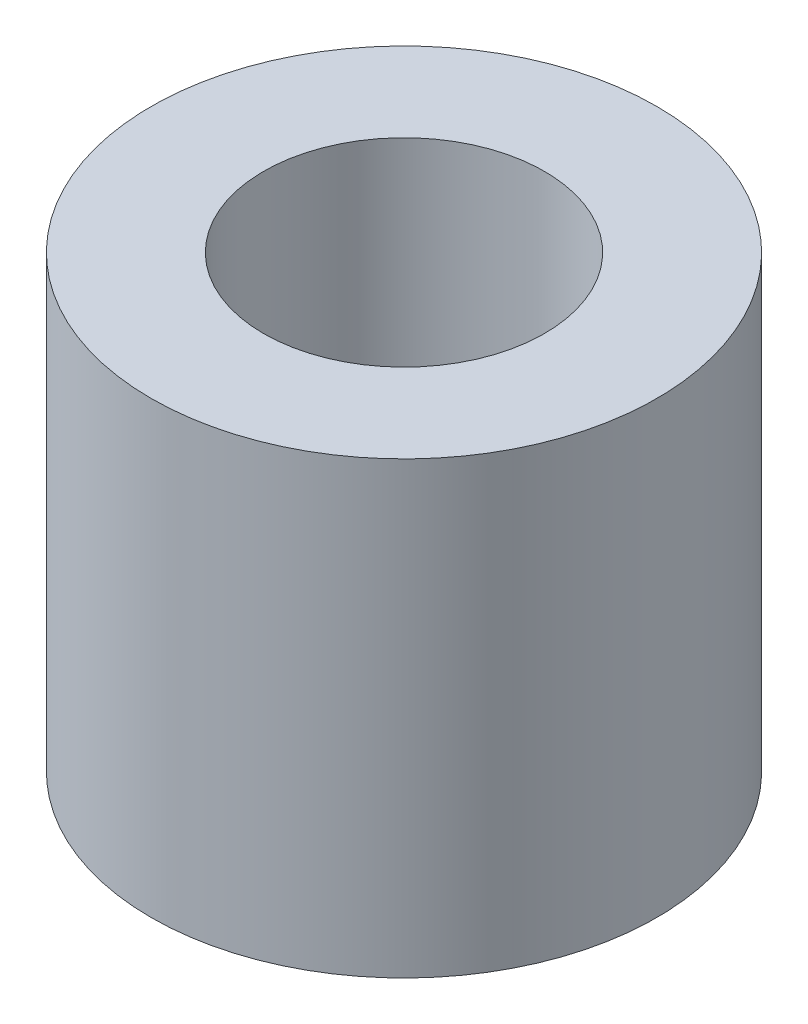
ISO-10303-21;
HEADER;
FILE_DESCRIPTION(('STEP AP214'),'2;1');
FILE_NAME('part.step','',(''),(''),'','','');
FILE_SCHEMA(('AUTOMOTIVE_DESIGN { 1 0 10303 214 1 1 1 1 }'));
ENDSEC;
DATA;
#1=APPLICATION_CONTEXT('core data for automotive mechanical design processes');
#2=APPLICATION_PROTOCOL_DEFINITION('international standard','automotive_design',2000,#1);
#3=PRODUCT_CONTEXT('',#1,'mechanical');
#4=PRODUCT('Part','Part','',(#3));
#5=PRODUCT_RELATED_PRODUCT_CATEGORY('part','',(#4));
#6=PRODUCT_DEFINITION_FORMATION('','',#4);
#7=PRODUCT_DEFINITION_CONTEXT('part definition',#1,'design');
#8=PRODUCT_DEFINITION('design','',#6,#7);
#9=PRODUCT_DEFINITION_SHAPE('','',#8);
#10=(LENGTH_UNIT() NAMED_UNIT(*) SI_UNIT(.MILLI.,.METRE.));
#11=(NAMED_UNIT(*) PLANE_ANGLE_UNIT() SI_UNIT($,.RADIAN.));
#12=(NAMED_UNIT(*) SI_UNIT($,.STERADIAN.) SOLID_ANGLE_UNIT());
#13=UNCERTAINTY_MEASURE_WITH_UNIT(LENGTH_MEASURE(1.E-05),#10,'distance_accuracy_value','');
#14=(GEOMETRIC_REPRESENTATION_CONTEXT(3) GLOBAL_UNCERTAINTY_ASSIGNED_CONTEXT((#13)) GLOBAL_UNIT_ASSIGNED_CONTEXT((#10,
#11,#12)) REPRESENTATION_CONTEXT('',''));
#15=CARTESIAN_POINT('',(0.,0.,0.));
#16=DIRECTION('',(0.,0.,1.));
#17=DIRECTION('',(1.,0.,0.));
#18=AXIS2_PLACEMENT_3D('',#15,#16,#17);
#19=CARTESIAN_POINT('',(0.,8.,0.));
#20=DIRECTION('',(0.,1.,0.));
#21=DIRECTION('',(0.,0.,1.));
#22=AXIS2_PLACEMENT_3D('',#19,#20,#21);
#23=PLANE('',#22);
#24=CARTESIAN_POINT('',(0.,8.,0.));
#25=DIRECTION('',(0.,1.,0.));
#26=DIRECTION('',(0.,0.,1.));
#27=AXIS2_PLACEMENT_3D('',#24,#25,#26);
#28=CIRCLE('',#27,4.5);
#29=CARTESIAN_POINT('',(0.,8.,4.5));
#30=VERTEX_POINT('',#29);
#31=EDGE_CURVE('E10',#30,#30,#28,.T.);
#32=ORIENTED_EDGE('',*,*,#31,.T.);
#33=EDGE_LOOP('',(#32));
#34=FACE_BOUND('',#33,.T.);
#35=CARTESIAN_POINT('',(0.,8.,0.));
#36=DIRECTION('',(0.,1.,0.));
#37=DIRECTION('',(0.,0.,1.));
#38=AXIS2_PLACEMENT_3D('',#35,#36,#37);
#39=CIRCLE('',#38,2.5);
#40=CARTESIAN_POINT('',(0.,8.,2.5));
#41=VERTEX_POINT('',#40);
#42=EDGE_CURVE('E44',#41,#41,#39,.T.);
#43=ORIENTED_EDGE('',*,*,#42,.F.);
#44=EDGE_LOOP('',(#43));
#45=FACE_BOUND('',#44,.T.);
#46=ADVANCED_FACE('F33',(#34,#45),#23,.T.);
#47=CARTESIAN_POINT('',(0.,0.,0.));
#48=DIRECTION('',(0.,1.,0.));
#49=DIRECTION('',(0.,0.,1.));
#50=AXIS2_PLACEMENT_3D('',#47,#48,#49);
#51=PLANE('',#50);
#52=CARTESIAN_POINT('',(0.,0.,0.));
#53=DIRECTION('',(0.,1.,0.));
#54=DIRECTION('',(0.,0.,1.));
#55=AXIS2_PLACEMENT_3D('',#52,#53,#54);
#56=CIRCLE('',#55,4.5);
#57=CARTESIAN_POINT('',(0.,0.,4.5));
#58=VERTEX_POINT('',#57);
#59=EDGE_CURVE('E37',#58,#58,#56,.T.);
#60=ORIENTED_EDGE('',*,*,#59,.F.);
#61=EDGE_LOOP('',(#60));
#62=FACE_BOUND('',#61,.T.);
#63=CARTESIAN_POINT('',(0.,0.,0.));
#64=DIRECTION('',(0.,1.,0.));
#65=DIRECTION('',(0.,0.,1.));
#66=AXIS2_PLACEMENT_3D('',#63,#64,#65);
#67=CIRCLE('',#66,2.5);
#68=CARTESIAN_POINT('',(0.,0.,2.5));
#69=VERTEX_POINT('',#68);
#70=EDGE_CURVE('E46',#69,#69,#67,.T.);
#71=ORIENTED_EDGE('',*,*,#70,.T.);
#72=EDGE_LOOP('',(#71));
#73=FACE_BOUND('',#72,.T.);
#74=ADVANCED_FACE('F56',(#62,#73),#51,.F.);
#75=CARTESIAN_POINT('',(0.,8.,0.));
#76=DIRECTION('',(0.,-1.,0.));
#77=DIRECTION('',(0.,0.,-1.));
#78=AXIS2_PLACEMENT_3D('',#75,#76,#77);
#79=CYLINDRICAL_SURFACE('',#78,4.5);
#80=ORIENTED_EDGE('',*,*,#31,.F.);
#81=EDGE_LOOP('',(#80));
#82=FACE_BOUND('',#81,.T.);
#83=ORIENTED_EDGE('',*,*,#59,.T.);
#84=EDGE_LOOP('',(#83));
#85=FACE_BOUND('',#84,.T.);
#86=ADVANCED_FACE('F35',(#82,#85),#79,.T.);
#87=CARTESIAN_POINT('',(0.,8.,0.));
#88=DIRECTION('',(0.,-1.,0.));
#89=DIRECTION('',(0.,0.,-1.));
#90=AXIS2_PLACEMENT_3D('',#87,#88,#89);
#91=CYLINDRICAL_SURFACE('',#90,2.5);
#92=ORIENTED_EDGE('',*,*,#42,.T.);
#93=EDGE_LOOP('',(#92));
#94=FACE_BOUND('',#93,.T.);
#95=ORIENTED_EDGE('',*,*,#70,.F.);
#96=EDGE_LOOP('',(#95));
#97=FACE_BOUND('',#96,.T.);
#98=ADVANCED_FACE('F52',(#94,#97),#91,.F.);
#99=CLOSED_SHELL('',(#46,#74,#86,#98));
#100=MANIFOLD_SOLID_BREP('B2',#99);
#101=ADVANCED_BREP_SHAPE_REPRESENTATION('',(#18,#100),#14);
#102=SHAPE_DEFINITION_REPRESENTATION(#9,#101);
ENDSEC;
END-ISO-10303-21;
